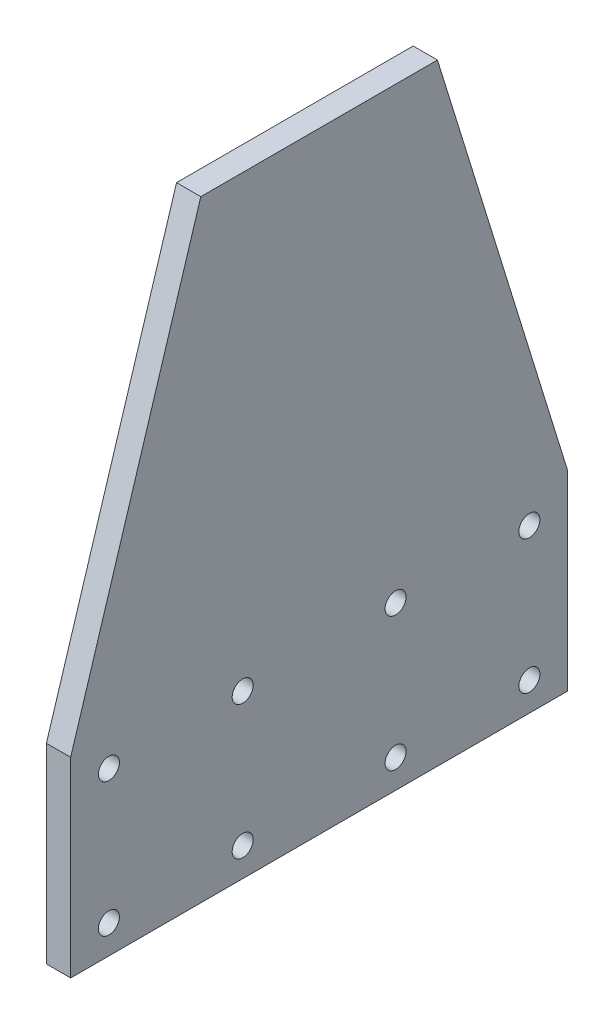
ISO-10303-21;
HEADER;
FILE_DESCRIPTION(('STEP AP214'),'2;1');
FILE_NAME('part.step','',(''),(''),'','','');
FILE_SCHEMA(('AUTOMOTIVE_DESIGN { 1 0 10303 214 1 1 1 1 }'));
ENDSEC;
DATA;
#1=APPLICATION_CONTEXT('core data for automotive mechanical design processes');
#2=APPLICATION_PROTOCOL_DEFINITION('international standard','automotive_design',2000,#1);
#3=PRODUCT_CONTEXT('',#1,'mechanical');
#4=PRODUCT('Part','Part','',(#3));
#5=PRODUCT_RELATED_PRODUCT_CATEGORY('part','',(#4));
#6=PRODUCT_DEFINITION_FORMATION('','',#4);
#7=PRODUCT_DEFINITION_CONTEXT('part definition',#1,'design');
#8=PRODUCT_DEFINITION('design','',#6,#7);
#9=PRODUCT_DEFINITION_SHAPE('','',#8);
#10=(LENGTH_UNIT() NAMED_UNIT(*) SI_UNIT(.MILLI.,.METRE.));
#11=(NAMED_UNIT(*) PLANE_ANGLE_UNIT() SI_UNIT($,.RADIAN.));
#12=(NAMED_UNIT(*) SI_UNIT($,.STERADIAN.) SOLID_ANGLE_UNIT());
#13=UNCERTAINTY_MEASURE_WITH_UNIT(LENGTH_MEASURE(1.E-05),#10,'distance_accuracy_value','');
#14=(GEOMETRIC_REPRESENTATION_CONTEXT(3) GLOBAL_UNCERTAINTY_ASSIGNED_CONTEXT((#13)) GLOBAL_UNIT_ASSIGNED_CONTEXT((#10,
#11,#12)) REPRESENTATION_CONTEXT('',''));
#15=CARTESIAN_POINT('',(0.,0.,0.));
#16=DIRECTION('',(0.,0.,1.));
#17=DIRECTION('',(1.,0.,0.));
#18=AXIS2_PLACEMENT_3D('',#15,#16,#17);
#19=CARTESIAN_POINT('',(6.35,0.,0.));
#20=DIRECTION('',(0.,0.,-1.));
#21=DIRECTION('',(-1.,0.,0.));
#22=AXIS2_PLACEMENT_3D('',#19,#20,#21);
#23=PLANE('',#22);
#24=DIRECTION('',(0.,-1.,0.));
#25=VECTOR('',#24,1.);
#26=CARTESIAN_POINT('',(0.,0.,0.));
#27=LINE('',#26,#25);
#28=CARTESIAN_POINT('',(0.,50.,0.));
#29=VERTEX_POINT('',#28);
#30=CARTESIAN_POINT('',(0.,0.,0.));
#31=VERTEX_POINT('',#30);
#32=EDGE_CURVE('E132',#29,#31,#27,.T.);
#33=ORIENTED_EDGE('',*,*,#32,.T.);
#34=DIRECTION('',(-1.,0.,0.));
#35=VECTOR('',#34,1.);
#36=CARTESIAN_POINT('',(6.35,0.,0.));
#37=LINE('',#36,#35);
#38=CARTESIAN_POINT('',(6.35,0.,0.));
#39=VERTEX_POINT('',#38);
#40=EDGE_CURVE('E11',#39,#31,#37,.T.);
#41=ORIENTED_EDGE('',*,*,#40,.F.);
#42=DIRECTION('',(0.,-1.,0.));
#43=VECTOR('',#42,1.);
#44=CARTESIAN_POINT('',(6.35,0.,0.));
#45=LINE('',#44,#43);
#46=CARTESIAN_POINT('',(6.35,50.,0.));
#47=VERTEX_POINT('',#46);
#48=EDGE_CURVE('E149',#47,#39,#45,.T.);
#49=ORIENTED_EDGE('',*,*,#48,.F.);
#50=DIRECTION('',(-1.,0.,0.));
#51=VECTOR('',#50,1.);
#52=CARTESIAN_POINT('',(6.35,50.,0.));
#53=LINE('',#52,#51);
#54=EDGE_CURVE('E128',#47,#29,#53,.T.);
#55=ORIENTED_EDGE('',*,*,#54,.T.);
#56=EDGE_LOOP('',(#33,#41,#49,#55));
#57=FACE_BOUND('',#56,.T.);
#58=ADVANCED_FACE('F43',(#57),#23,.F.);
#59=CARTESIAN_POINT('',(6.35,0.,0.));
#60=DIRECTION('',(0.,1.,0.));
#61=DIRECTION('',(0.,0.,1.));
#62=AXIS2_PLACEMENT_3D('',#59,#60,#61);
#63=PLANE('',#62);
#64=DIRECTION('',(0.,0.,-1.));
#65=VECTOR('',#64,1.);
#66=CARTESIAN_POINT('',(0.,0.,0.));
#67=LINE('',#66,#65);
#68=CARTESIAN_POINT('',(0.,0.,-130.));
#69=VERTEX_POINT('',#68);
#70=EDGE_CURVE('E136',#31,#69,#67,.T.);
#71=ORIENTED_EDGE('',*,*,#70,.T.);
#72=DIRECTION('',(-1.,0.,0.));
#73=VECTOR('',#72,1.);
#74=CARTESIAN_POINT('',(6.35,0.,-130.));
#75=LINE('',#74,#73);
#76=CARTESIAN_POINT('',(6.35,0.,-130.));
#77=VERTEX_POINT('',#76);
#78=EDGE_CURVE('E52',#77,#69,#75,.T.);
#79=ORIENTED_EDGE('',*,*,#78,.F.);
#80=DIRECTION('',(0.,0.,-1.));
#81=VECTOR('',#80,1.);
#82=CARTESIAN_POINT('',(6.35,0.,0.));
#83=LINE('',#82,#81);
#84=EDGE_CURVE('E97',#39,#77,#83,.T.);
#85=ORIENTED_EDGE('',*,*,#84,.F.);
#86=ORIENTED_EDGE('',*,*,#40,.T.);
#87=EDGE_LOOP('',(#71,#79,#85,#86));
#88=FACE_BOUND('',#87,.T.);
#89=ADVANCED_FACE('F178',(#88),#63,.F.);
#90=CARTESIAN_POINT('',(6.35,0.,-130.));
#91=DIRECTION('',(0.,0.,1.));
#92=DIRECTION('',(1.,0.,0.));
#93=AXIS2_PLACEMENT_3D('',#90,#91,#92);
#94=PLANE('',#93);
#95=DIRECTION('',(0.,1.,0.));
#96=VECTOR('',#95,1.);
#97=CARTESIAN_POINT('',(0.,0.,-130.));
#98=LINE('',#97,#96);
#99=CARTESIAN_POINT('',(0.,50.,-130.));
#100=VERTEX_POINT('',#99);
#101=EDGE_CURVE('E140',#69,#100,#98,.T.);
#102=ORIENTED_EDGE('',*,*,#101,.T.);
#103=DIRECTION('',(-1.,0.,0.));
#104=VECTOR('',#103,1.);
#105=CARTESIAN_POINT('',(6.35,50.,-130.));
#106=LINE('',#105,#104);
#107=CARTESIAN_POINT('',(6.35,50.,-130.));
#108=VERTEX_POINT('',#107);
#109=EDGE_CURVE('E121',#108,#100,#106,.T.);
#110=ORIENTED_EDGE('',*,*,#109,.F.);
#111=DIRECTION('',(0.,1.,0.));
#112=VECTOR('',#111,1.);
#113=CARTESIAN_POINT('',(6.35,0.,-130.));
#114=LINE('',#113,#112);
#115=EDGE_CURVE('E110',#77,#108,#114,.T.);
#116=ORIENTED_EDGE('',*,*,#115,.F.);
#117=ORIENTED_EDGE('',*,*,#78,.T.);
#118=EDGE_LOOP('',(#102,#110,#116,#117));
#119=FACE_BOUND('',#118,.T.);
#120=ADVANCED_FACE('F159',(#119),#94,.F.);
#121=CARTESIAN_POINT('',(6.35,50.,-130.));
#122=DIRECTION('',(0.,-0.295683728071131,0.955285890691346));
#123=DIRECTION('',(0.,-0.955285890691346,-0.295683728071131));
#124=AXIS2_PLACEMENT_3D('',#121,#122,#123);
#125=PLANE('',#124);
#126=DIRECTION('',(0.,0.955285890691346,0.295683728071131));
#127=VECTOR('',#126,1.);
#128=CARTESIAN_POINT('',(0.,50.,-130.));
#129=LINE('',#128,#127);
#130=CARTESIAN_POINT('',(0.,160.,-95.9523809523809));
#131=VERTEX_POINT('',#130);
#132=EDGE_CURVE('E119',#100,#131,#129,.T.);
#133=ORIENTED_EDGE('',*,*,#132,.T.);
#134=DIRECTION('',(-1.,0.,0.));
#135=VECTOR('',#134,1.);
#136=CARTESIAN_POINT('',(6.35,160.,-95.9523809523809));
#137=LINE('',#136,#135);
#138=CARTESIAN_POINT('',(6.35,160.,-95.9523809523809));
#139=VERTEX_POINT('',#138);
#140=EDGE_CURVE('E116',#139,#131,#137,.T.);
#141=ORIENTED_EDGE('',*,*,#140,.F.);
#142=DIRECTION('',(0.,0.955285890691346,0.295683728071131));
#143=VECTOR('',#142,1.);
#144=CARTESIAN_POINT('',(6.35,50.,-130.));
#145=LINE('',#144,#143);
#146=EDGE_CURVE('E104',#108,#139,#145,.T.);
#147=ORIENTED_EDGE('',*,*,#146,.F.);
#148=ORIENTED_EDGE('',*,*,#109,.T.);
#149=EDGE_LOOP('',(#133,#141,#147,#148));
#150=FACE_BOUND('',#149,.T.);
#151=ADVANCED_FACE('F117',(#150),#125,.F.);
#152=CARTESIAN_POINT('',(6.35,160.,-34.0476190476191));
#153=DIRECTION('',(0.,-1.,0.));
#154=DIRECTION('',(0.,0.,-1.));
#155=AXIS2_PLACEMENT_3D('',#152,#153,#154);
#156=PLANE('',#155);
#157=DIRECTION('',(0.,0.,1.));
#158=VECTOR('',#157,1.);
#159=CARTESIAN_POINT('',(0.,160.,-34.0476190476191));
#160=LINE('',#159,#158);
#161=CARTESIAN_POINT('',(0.,160.,-34.0476190476191));
#162=VERTEX_POINT('',#161);
#163=EDGE_CURVE('E83',#131,#162,#160,.T.);
#164=ORIENTED_EDGE('',*,*,#163,.T.);
#165=DIRECTION('',(-1.,0.,0.));
#166=VECTOR('',#165,1.);
#167=CARTESIAN_POINT('',(6.35,160.,-34.0476190476191));
#168=LINE('',#167,#166);
#169=CARTESIAN_POINT('',(6.35,160.,-34.0476190476191));
#170=VERTEX_POINT('',#169);
#171=EDGE_CURVE('E122',#170,#162,#168,.T.);
#172=ORIENTED_EDGE('',*,*,#171,.F.);
#173=DIRECTION('',(0.,0.,1.));
#174=VECTOR('',#173,1.);
#175=CARTESIAN_POINT('',(6.35,160.,-34.0476190476191));
#176=LINE('',#175,#174);
#177=EDGE_CURVE('E108',#139,#170,#176,.T.);
#178=ORIENTED_EDGE('',*,*,#177,.F.);
#179=ORIENTED_EDGE('',*,*,#140,.T.);
#180=EDGE_LOOP('',(#164,#172,#178,#179));
#181=FACE_BOUND('',#180,.T.);
#182=ADVANCED_FACE('F124',(#181),#156,.F.);
#183=CARTESIAN_POINT('',(6.35,50.,0.));
#184=DIRECTION('',(0.,-0.295683728071131,-0.955285890691346));
#185=DIRECTION('',(0.,0.955285890691346,-0.295683728071131));
#186=AXIS2_PLACEMENT_3D('',#183,#184,#185);
#187=PLANE('',#186);
#188=DIRECTION('',(0.,-0.955285890691346,0.295683728071131));
#189=VECTOR('',#188,1.);
#190=CARTESIAN_POINT('',(0.,50.,0.));
#191=LINE('',#190,#189);
#192=EDGE_CURVE('E89',#162,#29,#191,.T.);
#193=ORIENTED_EDGE('',*,*,#192,.T.);
#194=ORIENTED_EDGE('',*,*,#54,.F.);
#195=DIRECTION('',(0.,-0.955285890691346,0.295683728071131));
#196=VECTOR('',#195,1.);
#197=CARTESIAN_POINT('',(6.35,50.,0.));
#198=LINE('',#197,#196);
#199=EDGE_CURVE('E60',#170,#47,#198,.T.);
#200=ORIENTED_EDGE('',*,*,#199,.F.);
#201=ORIENTED_EDGE('',*,*,#171,.T.);
#202=EDGE_LOOP('',(#193,#194,#200,#201));
#203=FACE_BOUND('',#202,.T.);
#204=ADVANCED_FACE('F166',(#203),#187,.F.);
#205=CARTESIAN_POINT('',(6.35,0.,0.));
#206=DIRECTION('',(-1.,0.,0.));
#207=DIRECTION('',(0.,0.,1.));
#208=AXIS2_PLACEMENT_3D('',#205,#206,#207);
#209=PLANE('',#208);
#210=CARTESIAN_POINT('',(6.35,7.50000000000003,-120.));
#211=DIRECTION('',(1.,0.,0.));
#212=DIRECTION('',(0.,0.,1.));
#213=AXIS2_PLACEMENT_3D('',#210,#211,#212);
#214=CIRCLE('',#213,2.75000000000001);
#215=CARTESIAN_POINT('',(6.35,7.50000000000003,-117.25));
#216=VERTEX_POINT('',#215);
#217=EDGE_CURVE('E350',#216,#216,#214,.T.);
#218=ORIENTED_EDGE('',*,*,#217,.F.);
#219=EDGE_LOOP('',(#218));
#220=FACE_BOUND('',#219,.T.);
#221=CARTESIAN_POINT('',(6.35,7.50000000000001,-45.0000000000001));
#222=DIRECTION('',(1.,0.,0.));
#223=DIRECTION('',(0.,0.,-1.));
#224=AXIS2_PLACEMENT_3D('',#221,#222,#223);
#225=CIRCLE('',#224,2.75);
#226=CARTESIAN_POINT('',(6.35,7.50000000000001,-47.7500000000001));
#227=VERTEX_POINT('',#226);
#228=EDGE_CURVE('E357',#227,#227,#225,.T.);
#229=ORIENTED_EDGE('',*,*,#228,.F.);
#230=EDGE_LOOP('',(#229));
#231=FACE_BOUND('',#230,.T.);
#232=CARTESIAN_POINT('',(6.35,7.50000000000002,-9.99999999999998));
#233=DIRECTION('',(1.,0.,0.));
#234=DIRECTION('',(0.,0.,-1.));
#235=AXIS2_PLACEMENT_3D('',#232,#233,#234);
#236=CIRCLE('',#235,2.75);
#237=CARTESIAN_POINT('',(6.35,7.50000000000002,-12.75));
#238=VERTEX_POINT('',#237);
#239=EDGE_CURVE('E372',#238,#238,#236,.T.);
#240=ORIENTED_EDGE('',*,*,#239,.F.);
#241=EDGE_LOOP('',(#240));
#242=FACE_BOUND('',#241,.T.);
#243=CARTESIAN_POINT('',(6.35,42.5,-45.));
#244=DIRECTION('',(1.,0.,0.));
#245=DIRECTION('',(0.,0.,-1.));
#246=AXIS2_PLACEMENT_3D('',#243,#244,#245);
#247=CIRCLE('',#246,2.75);
#248=CARTESIAN_POINT('',(6.35,42.5,-47.75));
#249=VERTEX_POINT('',#248);
#250=EDGE_CURVE('E363',#249,#249,#247,.T.);
#251=ORIENTED_EDGE('',*,*,#250,.F.);
#252=EDGE_LOOP('',(#251));
#253=FACE_BOUND('',#252,.T.);
#254=CARTESIAN_POINT('',(6.35,7.50000000000001,-85.));
#255=DIRECTION('',(1.,0.,0.));
#256=DIRECTION('',(0.,0.,1.));
#257=AXIS2_PLACEMENT_3D('',#254,#255,#256);
#258=CIRCLE('',#257,2.74999999999998);
#259=CARTESIAN_POINT('',(6.35,7.50000000000001,-82.25));
#260=VERTEX_POINT('',#259);
#261=EDGE_CURVE('E359',#260,#260,#258,.T.);
#262=ORIENTED_EDGE('',*,*,#261,.F.);
#263=EDGE_LOOP('',(#262));
#264=FACE_BOUND('',#263,.T.);
#265=CARTESIAN_POINT('',(6.35,42.5,-85.));
#266=DIRECTION('',(1.,0.,0.));
#267=DIRECTION('',(0.,0.,1.));
#268=AXIS2_PLACEMENT_3D('',#265,#266,#267);
#269=CIRCLE('',#268,2.75000000000001);
#270=CARTESIAN_POINT('',(6.35,42.5,-82.25));
#271=VERTEX_POINT('',#270);
#272=EDGE_CURVE('E407',#271,#271,#269,.T.);
#273=ORIENTED_EDGE('',*,*,#272,.F.);
#274=EDGE_LOOP('',(#273));
#275=FACE_BOUND('',#274,.T.);
#276=CARTESIAN_POINT('',(6.35,42.5,-120.));
#277=DIRECTION('',(1.,0.,0.));
#278=DIRECTION('',(0.,0.,1.));
#279=AXIS2_PLACEMENT_3D('',#276,#277,#278);
#280=CIRCLE('',#279,2.74999999999998);
#281=CARTESIAN_POINT('',(6.35,42.5,-117.25));
#282=VERTEX_POINT('',#281);
#283=EDGE_CURVE('E399',#282,#282,#280,.T.);
#284=ORIENTED_EDGE('',*,*,#283,.F.);
#285=EDGE_LOOP('',(#284));
#286=FACE_BOUND('',#285,.T.);
#287=CARTESIAN_POINT('',(6.35,42.5,-9.99999999999999));
#288=DIRECTION('',(1.,0.,0.));
#289=DIRECTION('',(0.,0.,-1.));
#290=AXIS2_PLACEMENT_3D('',#287,#288,#289);
#291=CIRCLE('',#290,2.75);
#292=CARTESIAN_POINT('',(6.35,42.5,-12.75));
#293=VERTEX_POINT('',#292);
#294=EDGE_CURVE('E367',#293,#293,#291,.T.);
#295=ORIENTED_EDGE('',*,*,#294,.F.);
#296=EDGE_LOOP('',(#295));
#297=FACE_BOUND('',#296,.T.);
#298=ORIENTED_EDGE('',*,*,#48,.T.);
#299=ORIENTED_EDGE('',*,*,#84,.T.);
#300=ORIENTED_EDGE('',*,*,#115,.T.);
#301=ORIENTED_EDGE('',*,*,#146,.T.);
#302=ORIENTED_EDGE('',*,*,#177,.T.);
#303=ORIENTED_EDGE('',*,*,#199,.T.);
#304=EDGE_LOOP('',(#298,#299,#300,#301,#302,#303));
#305=FACE_BOUND('',#304,.T.);
#306=ADVANCED_FACE('F106',(#220,#231,#242,#253,#264,#275,#286,#297,#305),#209,.F.);
#307=CARTESIAN_POINT('',(0.,0.,0.));
#308=DIRECTION('',(-1.,0.,0.));
#309=DIRECTION('',(0.,0.,1.));
#310=AXIS2_PLACEMENT_3D('',#307,#308,#309);
#311=PLANE('',#310);
#312=CARTESIAN_POINT('',(0.,7.50000000000003,-120.));
#313=DIRECTION('',(1.,0.,0.));
#314=DIRECTION('',(0.,0.,1.));
#315=AXIS2_PLACEMENT_3D('',#312,#313,#314);
#316=CIRCLE('',#315,2.75000000000001);
#317=CARTESIAN_POINT('',(0.,7.50000000000003,-117.25));
#318=VERTEX_POINT('',#317);
#319=EDGE_CURVE('E347',#318,#318,#316,.T.);
#320=ORIENTED_EDGE('',*,*,#319,.T.);
#321=EDGE_LOOP('',(#320));
#322=FACE_BOUND('',#321,.T.);
#323=CARTESIAN_POINT('',(0.,7.50000000000001,-45.0000000000001));
#324=DIRECTION('',(1.,0.,0.));
#325=DIRECTION('',(0.,0.,-1.));
#326=AXIS2_PLACEMENT_3D('',#323,#324,#325);
#327=CIRCLE('',#326,2.75);
#328=CARTESIAN_POINT('',(0.,7.50000000000001,-47.7500000000001));
#329=VERTEX_POINT('',#328);
#330=EDGE_CURVE('E352',#329,#329,#327,.T.);
#331=ORIENTED_EDGE('',*,*,#330,.T.);
#332=EDGE_LOOP('',(#331));
#333=FACE_BOUND('',#332,.T.);
#334=CARTESIAN_POINT('',(0.,7.50000000000002,-9.99999999999998));
#335=DIRECTION('',(1.,0.,0.));
#336=DIRECTION('',(0.,0.,-1.));
#337=AXIS2_PLACEMENT_3D('',#334,#335,#336);
#338=CIRCLE('',#337,2.75);
#339=CARTESIAN_POINT('',(0.,7.50000000000002,-12.75));
#340=VERTEX_POINT('',#339);
#341=EDGE_CURVE('E376',#340,#340,#338,.T.);
#342=ORIENTED_EDGE('',*,*,#341,.T.);
#343=EDGE_LOOP('',(#342));
#344=FACE_BOUND('',#343,.T.);
#345=CARTESIAN_POINT('',(0.,42.5,-45.));
#346=DIRECTION('',(1.,0.,0.));
#347=DIRECTION('',(0.,0.,-1.));
#348=AXIS2_PLACEMENT_3D('',#345,#346,#347);
#349=CIRCLE('',#348,2.75);
#350=CARTESIAN_POINT('',(0.,42.5,-47.75));
#351=VERTEX_POINT('',#350);
#352=EDGE_CURVE('E368',#351,#351,#349,.T.);
#353=ORIENTED_EDGE('',*,*,#352,.T.);
#354=EDGE_LOOP('',(#353));
#355=FACE_BOUND('',#354,.T.);
#356=CARTESIAN_POINT('',(0.,7.50000000000001,-85.));
#357=DIRECTION('',(1.,0.,0.));
#358=DIRECTION('',(0.,0.,1.));
#359=AXIS2_PLACEMENT_3D('',#356,#357,#358);
#360=CIRCLE('',#359,2.74999999999998);
#361=CARTESIAN_POINT('',(0.,7.50000000000001,-82.25));
#362=VERTEX_POINT('',#361);
#363=EDGE_CURVE('E411',#362,#362,#360,.T.);
#364=ORIENTED_EDGE('',*,*,#363,.T.);
#365=EDGE_LOOP('',(#364));
#366=FACE_BOUND('',#365,.T.);
#367=CARTESIAN_POINT('',(0.,42.5,-85.));
#368=DIRECTION('',(1.,0.,0.));
#369=DIRECTION('',(0.,0.,1.));
#370=AXIS2_PLACEMENT_3D('',#367,#368,#369);
#371=CIRCLE('',#370,2.75000000000001);
#372=CARTESIAN_POINT('',(0.,42.5,-82.25));
#373=VERTEX_POINT('',#372);
#374=EDGE_CURVE('E403',#373,#373,#371,.T.);
#375=ORIENTED_EDGE('',*,*,#374,.T.);
#376=EDGE_LOOP('',(#375));
#377=FACE_BOUND('',#376,.T.);
#378=CARTESIAN_POINT('',(0.,42.5,-120.));
#379=DIRECTION('',(1.,0.,0.));
#380=DIRECTION('',(0.,0.,1.));
#381=AXIS2_PLACEMENT_3D('',#378,#379,#380);
#382=CIRCLE('',#381,2.74999999999998);
#383=CARTESIAN_POINT('',(0.,42.5,-117.25));
#384=VERTEX_POINT('',#383);
#385=EDGE_CURVE('E395',#384,#384,#382,.T.);
#386=ORIENTED_EDGE('',*,*,#385,.T.);
#387=EDGE_LOOP('',(#386));
#388=FACE_BOUND('',#387,.T.);
#389=CARTESIAN_POINT('',(0.,42.5,-9.99999999999999));
#390=DIRECTION('',(1.,0.,0.));
#391=DIRECTION('',(0.,0.,-1.));
#392=AXIS2_PLACEMENT_3D('',#389,#390,#391);
#393=CIRCLE('',#392,2.75);
#394=CARTESIAN_POINT('',(0.,42.5,-12.75));
#395=VERTEX_POINT('',#394);
#396=EDGE_CURVE('E137',#395,#395,#393,.T.);
#397=ORIENTED_EDGE('',*,*,#396,.T.);
#398=EDGE_LOOP('',(#397));
#399=FACE_BOUND('',#398,.T.);
#400=ORIENTED_EDGE('',*,*,#32,.F.);
#401=ORIENTED_EDGE('',*,*,#192,.F.);
#402=ORIENTED_EDGE('',*,*,#163,.F.);
#403=ORIENTED_EDGE('',*,*,#132,.F.);
#404=ORIENTED_EDGE('',*,*,#101,.F.);
#405=ORIENTED_EDGE('',*,*,#70,.F.);
#406=EDGE_LOOP('',(#400,#401,#402,#403,#404,#405));
#407=FACE_BOUND('',#406,.T.);
#408=ADVANCED_FACE('F162',(#322,#333,#344,#355,#366,#377,#388,#399,#407),#311,.T.);
#409=CARTESIAN_POINT('',(0.,42.5,-9.99999999999999));
#410=DIRECTION('',(1.,0.,0.));
#411=DIRECTION('',(0.,0.,-1.));
#412=AXIS2_PLACEMENT_3D('',#409,#410,#411);
#413=CYLINDRICAL_SURFACE('',#412,2.75);
#414=ORIENTED_EDGE('',*,*,#396,.F.);
#415=EDGE_LOOP('',(#414));
#416=FACE_BOUND('',#415,.T.);
#417=ORIENTED_EDGE('',*,*,#294,.T.);
#418=EDGE_LOOP('',(#417));
#419=FACE_BOUND('',#418,.T.);
#420=ADVANCED_FACE('F218',(#416,#419),#413,.F.);
#421=CARTESIAN_POINT('',(0.,42.5,-120.));
#422=DIRECTION('',(1.,0.,0.));
#423=DIRECTION('',(0.,0.,-1.));
#424=AXIS2_PLACEMENT_3D('',#421,#422,#423);
#425=CYLINDRICAL_SURFACE('',#424,2.74999999999998);
#426=ORIENTED_EDGE('',*,*,#385,.F.);
#427=EDGE_LOOP('',(#426));
#428=FACE_BOUND('',#427,.T.);
#429=ORIENTED_EDGE('',*,*,#283,.T.);
#430=EDGE_LOOP('',(#429));
#431=FACE_BOUND('',#430,.T.);
#432=ADVANCED_FACE('F228',(#428,#431),#425,.F.);
#433=CARTESIAN_POINT('',(0.,42.5,-85.));
#434=DIRECTION('',(1.,0.,0.));
#435=DIRECTION('',(0.,0.,-1.));
#436=AXIS2_PLACEMENT_3D('',#433,#434,#435);
#437=CYLINDRICAL_SURFACE('',#436,2.75000000000001);
#438=ORIENTED_EDGE('',*,*,#374,.F.);
#439=EDGE_LOOP('',(#438));
#440=FACE_BOUND('',#439,.T.);
#441=ORIENTED_EDGE('',*,*,#272,.T.);
#442=EDGE_LOOP('',(#441));
#443=FACE_BOUND('',#442,.T.);
#444=ADVANCED_FACE('F239',(#440,#443),#437,.F.);
#445=CARTESIAN_POINT('',(0.,7.50000000000001,-85.));
#446=DIRECTION('',(1.,0.,0.));
#447=DIRECTION('',(0.,0.,-1.));
#448=AXIS2_PLACEMENT_3D('',#445,#446,#447);
#449=CYLINDRICAL_SURFACE('',#448,2.74999999999998);
#450=ORIENTED_EDGE('',*,*,#363,.F.);
#451=EDGE_LOOP('',(#450));
#452=FACE_BOUND('',#451,.T.);
#453=ORIENTED_EDGE('',*,*,#261,.T.);
#454=EDGE_LOOP('',(#453));
#455=FACE_BOUND('',#454,.T.);
#456=ADVANCED_FACE('F250',(#452,#455),#449,.F.);
#457=CARTESIAN_POINT('',(0.,42.5,-45.));
#458=DIRECTION('',(1.,0.,0.));
#459=DIRECTION('',(0.,0.,-1.));
#460=AXIS2_PLACEMENT_3D('',#457,#458,#459);
#461=CYLINDRICAL_SURFACE('',#460,2.75);
#462=ORIENTED_EDGE('',*,*,#352,.F.);
#463=EDGE_LOOP('',(#462));
#464=FACE_BOUND('',#463,.T.);
#465=ORIENTED_EDGE('',*,*,#250,.T.);
#466=EDGE_LOOP('',(#465));
#467=FACE_BOUND('',#466,.T.);
#468=ADVANCED_FACE('F261',(#464,#467),#461,.F.);
#469=CARTESIAN_POINT('',(0.,7.50000000000002,-9.99999999999998));
#470=DIRECTION('',(1.,0.,0.));
#471=DIRECTION('',(0.,0.,-1.));
#472=AXIS2_PLACEMENT_3D('',#469,#470,#471);
#473=CYLINDRICAL_SURFACE('',#472,2.75);
#474=ORIENTED_EDGE('',*,*,#341,.F.);
#475=EDGE_LOOP('',(#474));
#476=FACE_BOUND('',#475,.T.);
#477=ORIENTED_EDGE('',*,*,#239,.T.);
#478=EDGE_LOOP('',(#477));
#479=FACE_BOUND('',#478,.T.);
#480=ADVANCED_FACE('F272',(#476,#479),#473,.F.);
#481=CARTESIAN_POINT('',(0.,7.50000000000001,-45.0000000000001));
#482=DIRECTION('',(1.,0.,0.));
#483=DIRECTION('',(0.,0.,-1.));
#484=AXIS2_PLACEMENT_3D('',#481,#482,#483);
#485=CYLINDRICAL_SURFACE('',#484,2.75);
#486=ORIENTED_EDGE('',*,*,#330,.F.);
#487=EDGE_LOOP('',(#486));
#488=FACE_BOUND('',#487,.T.);
#489=ORIENTED_EDGE('',*,*,#228,.T.);
#490=EDGE_LOOP('',(#489));
#491=FACE_BOUND('',#490,.T.);
#492=ADVANCED_FACE('F283',(#488,#491),#485,.F.);
#493=CARTESIAN_POINT('',(0.,7.50000000000003,-120.));
#494=DIRECTION('',(1.,0.,0.));
#495=DIRECTION('',(0.,0.,-1.));
#496=AXIS2_PLACEMENT_3D('',#493,#494,#495);
#497=CYLINDRICAL_SURFACE('',#496,2.75000000000001);
#498=ORIENTED_EDGE('',*,*,#319,.F.);
#499=EDGE_LOOP('',(#498));
#500=FACE_BOUND('',#499,.T.);
#501=ORIENTED_EDGE('',*,*,#217,.T.);
#502=EDGE_LOOP('',(#501));
#503=FACE_BOUND('',#502,.T.);
#504=ADVANCED_FACE('F294',(#500,#503),#497,.F.);
#505=CLOSED_SHELL('',(#58,#89,#120,#151,#182,#204,#306,#408,#420,#432,#444,#456,#468,#480,#492,#504));
#506=MANIFOLD_SOLID_BREP('B2',#505);
#507=ADVANCED_BREP_SHAPE_REPRESENTATION('',(#18,#506),#14);
#508=SHAPE_DEFINITION_REPRESENTATION(#9,#507);
ENDSEC;
END-ISO-10303-21;
